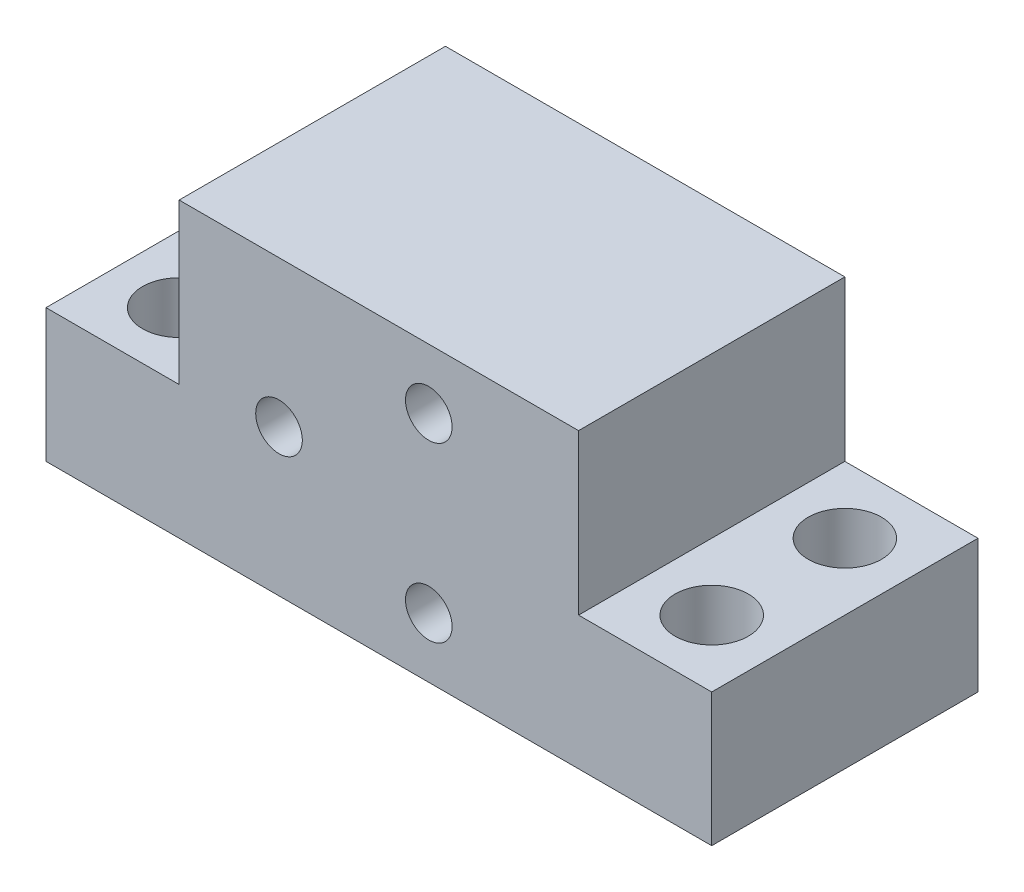
ISO-10303-21;
HEADER;
FILE_DESCRIPTION(('STEP AP214'),'2;1');
FILE_NAME('part.step','',(''),(''),'','','');
FILE_SCHEMA(('AUTOMOTIVE_DESIGN { 1 0 10303 214 1 1 1 1 }'));
ENDSEC;
DATA;
#1=APPLICATION_CONTEXT('core data for automotive mechanical design processes');
#2=APPLICATION_PROTOCOL_DEFINITION('international standard','automotive_design',2000,#1);
#3=PRODUCT_CONTEXT('',#1,'mechanical');
#4=PRODUCT('Part','Part','',(#3));
#5=PRODUCT_RELATED_PRODUCT_CATEGORY('part','',(#4));
#6=PRODUCT_DEFINITION_FORMATION('','',#4);
#7=PRODUCT_DEFINITION_CONTEXT('part definition',#1,'design');
#8=PRODUCT_DEFINITION('design','',#6,#7);
#9=PRODUCT_DEFINITION_SHAPE('','',#8);
#10=(LENGTH_UNIT() NAMED_UNIT(*) SI_UNIT(.MILLI.,.METRE.));
#11=(NAMED_UNIT(*) PLANE_ANGLE_UNIT() SI_UNIT($,.RADIAN.));
#12=(NAMED_UNIT(*) SI_UNIT($,.STERADIAN.) SOLID_ANGLE_UNIT());
#13=UNCERTAINTY_MEASURE_WITH_UNIT(LENGTH_MEASURE(1.E-05),#10,'distance_accuracy_value','');
#14=(GEOMETRIC_REPRESENTATION_CONTEXT(3) GLOBAL_UNCERTAINTY_ASSIGNED_CONTEXT((#13)) GLOBAL_UNIT_ASSIGNED_CONTEXT((#10,
#11,#12)) REPRESENTATION_CONTEXT('',''));
#15=CARTESIAN_POINT('',(0.,0.,0.));
#16=DIRECTION('',(0.,0.,1.));
#17=DIRECTION('',(1.,0.,0.));
#18=AXIS2_PLACEMENT_3D('',#15,#16,#17);
#19=CARTESIAN_POINT('',(15.,22.,-20.));
#20=DIRECTION('',(-1.,0.,0.));
#21=DIRECTION('',(0.,-1.,0.));
#22=AXIS2_PLACEMENT_3D('',#19,#20,#21);
#23=PLANE('',#22);
#24=DIRECTION('',(0.,1.,0.));
#25=VECTOR('',#24,1.);
#26=CARTESIAN_POINT('',(15.,22.,0.));
#27=LINE('',#26,#25);
#28=CARTESIAN_POINT('',(15.,10.,0.));
#29=VERTEX_POINT('',#28);
#30=CARTESIAN_POINT('',(15.,22.,0.));
#31=VERTEX_POINT('',#30);
#32=EDGE_CURVE('E113',#29,#31,#27,.T.);
#33=ORIENTED_EDGE('',*,*,#32,.F.);
#34=DIRECTION('',(0.,0.,1.));
#35=VECTOR('',#34,1.);
#36=CARTESIAN_POINT('',(15.,10.,-20.));
#37=LINE('',#36,#35);
#38=CARTESIAN_POINT('',(15.,10.,-20.));
#39=VERTEX_POINT('',#38);
#40=EDGE_CURVE('E112',#39,#29,#37,.T.);
#41=ORIENTED_EDGE('',*,*,#40,.F.);
#42=DIRECTION('',(0.,1.,0.));
#43=VECTOR('',#42,1.);
#44=CARTESIAN_POINT('',(15.,22.,-20.));
#45=LINE('',#44,#43);
#46=CARTESIAN_POINT('',(15.,22.,-20.));
#47=VERTEX_POINT('',#46);
#48=EDGE_CURVE('E132',#39,#47,#45,.T.);
#49=ORIENTED_EDGE('',*,*,#48,.T.);
#50=DIRECTION('',(0.,0.,1.));
#51=VECTOR('',#50,1.);
#52=CARTESIAN_POINT('',(15.,22.,-20.));
#53=LINE('',#52,#51);
#54=EDGE_CURVE('E11',#47,#31,#53,.T.);
#55=ORIENTED_EDGE('',*,*,#54,.T.);
#56=EDGE_LOOP('',(#33,#41,#49,#55));
#57=FACE_BOUND('',#56,.T.);
#58=ADVANCED_FACE('F17',(#57),#23,.F.);
#59=CARTESIAN_POINT('',(-15.,22.,-20.));
#60=DIRECTION('',(0.,-1.,0.));
#61=DIRECTION('',(0.,0.,1.));
#62=AXIS2_PLACEMENT_3D('',#59,#60,#61);
#63=PLANE('',#62);
#64=DIRECTION('',(-1.,0.,0.));
#65=VECTOR('',#64,1.);
#66=CARTESIAN_POINT('',(-15.,22.,0.));
#67=LINE('',#66,#65);
#68=CARTESIAN_POINT('',(-15.,22.,0.));
#69=VERTEX_POINT('',#68);
#70=EDGE_CURVE('E115',#31,#69,#67,.T.);
#71=ORIENTED_EDGE('',*,*,#70,.F.);
#72=ORIENTED_EDGE('',*,*,#54,.F.);
#73=DIRECTION('',(-1.,0.,0.));
#74=VECTOR('',#73,1.);
#75=CARTESIAN_POINT('',(-15.,22.,-20.));
#76=LINE('',#75,#74);
#77=CARTESIAN_POINT('',(-15.,22.,-20.));
#78=VERTEX_POINT('',#77);
#79=EDGE_CURVE('E71',#47,#78,#76,.T.);
#80=ORIENTED_EDGE('',*,*,#79,.T.);
#81=DIRECTION('',(0.,0.,1.));
#82=VECTOR('',#81,1.);
#83=CARTESIAN_POINT('',(-15.,22.,-20.));
#84=LINE('',#83,#82);
#85=EDGE_CURVE('E25',#78,#69,#84,.T.);
#86=ORIENTED_EDGE('',*,*,#85,.T.);
#87=EDGE_LOOP('',(#71,#72,#80,#86));
#88=FACE_BOUND('',#87,.T.);
#89=ADVANCED_FACE('F144',(#88),#63,.F.);
#90=CARTESIAN_POINT('',(-15.,22.,-20.));
#91=DIRECTION('',(1.,0.,0.));
#92=DIRECTION('',(0.,1.,0.));
#93=AXIS2_PLACEMENT_3D('',#90,#91,#92);
#94=PLANE('',#93);
#95=DIRECTION('',(0.,-1.,0.));
#96=VECTOR('',#95,1.);
#97=CARTESIAN_POINT('',(-15.,22.,0.));
#98=LINE('',#97,#96);
#99=CARTESIAN_POINT('',(-15.,10.,0.));
#100=VERTEX_POINT('',#99);
#101=EDGE_CURVE('E119',#69,#100,#98,.T.);
#102=ORIENTED_EDGE('',*,*,#101,.F.);
#103=ORIENTED_EDGE('',*,*,#85,.F.);
#104=DIRECTION('',(0.,-1.,0.));
#105=VECTOR('',#104,1.);
#106=CARTESIAN_POINT('',(-15.,22.,-20.));
#107=LINE('',#106,#105);
#108=CARTESIAN_POINT('',(-15.,10.,-20.));
#109=VERTEX_POINT('',#108);
#110=EDGE_CURVE('E153',#78,#109,#107,.T.);
#111=ORIENTED_EDGE('',*,*,#110,.T.);
#112=DIRECTION('',(0.,0.,1.));
#113=VECTOR('',#112,1.);
#114=CARTESIAN_POINT('',(-15.,10.,-20.));
#115=LINE('',#114,#113);
#116=EDGE_CURVE('E139',#109,#100,#115,.T.);
#117=ORIENTED_EDGE('',*,*,#116,.T.);
#118=EDGE_LOOP('',(#102,#103,#111,#117));
#119=FACE_BOUND('',#118,.T.);
#120=ADVANCED_FACE('F166',(#119),#94,.F.);
#121=CARTESIAN_POINT('',(-15.,10.,-20.));
#122=DIRECTION('',(0.,-1.,0.));
#123=DIRECTION('',(0.,0.,1.));
#124=AXIS2_PLACEMENT_3D('',#121,#122,#123);
#125=PLANE('',#124);
#126=CARTESIAN_POINT('',(-20.,10.,-15.));
#127=DIRECTION('',(0.,-1.,0.));
#128=DIRECTION('',(0.,0.,-1.));
#129=AXIS2_PLACEMENT_3D('',#126,#127,#128);
#130=CIRCLE('',#129,2.75);
#131=CARTESIAN_POINT('',(-20.,10.,-17.75));
#132=VERTEX_POINT('',#131);
#133=EDGE_CURVE('E370',#132,#132,#130,.T.);
#134=ORIENTED_EDGE('',*,*,#133,.T.);
#135=EDGE_LOOP('',(#134));
#136=FACE_BOUND('',#135,.T.);
#137=CARTESIAN_POINT('',(-20.,10.,-5.));
#138=DIRECTION('',(0.,-1.,0.));
#139=DIRECTION('',(0.,0.,-1.));
#140=AXIS2_PLACEMENT_3D('',#137,#138,#139);
#141=CIRCLE('',#140,2.75);
#142=CARTESIAN_POINT('',(-20.,10.,-7.75));
#143=VERTEX_POINT('',#142);
#144=EDGE_CURVE('E376',#143,#143,#141,.T.);
#145=ORIENTED_EDGE('',*,*,#144,.T.);
#146=EDGE_LOOP('',(#145));
#147=FACE_BOUND('',#146,.T.);
#148=DIRECTION('',(-1.,0.,0.));
#149=VECTOR('',#148,1.);
#150=CARTESIAN_POINT('',(-15.,10.,0.));
#151=LINE('',#150,#149);
#152=CARTESIAN_POINT('',(-25.,10.,0.));
#153=VERTEX_POINT('',#152);
#154=EDGE_CURVE('E122',#100,#153,#151,.T.);
#155=ORIENTED_EDGE('',*,*,#154,.F.);
#156=ORIENTED_EDGE('',*,*,#116,.F.);
#157=DIRECTION('',(-1.,0.,0.));
#158=VECTOR('',#157,1.);
#159=CARTESIAN_POINT('',(-15.,10.,-20.));
#160=LINE('',#159,#158);
#161=CARTESIAN_POINT('',(-25.,10.,-20.));
#162=VERTEX_POINT('',#161);
#163=EDGE_CURVE('E107',#109,#162,#160,.T.);
#164=ORIENTED_EDGE('',*,*,#163,.T.);
#165=DIRECTION('',(0.,0.,1.));
#166=VECTOR('',#165,1.);
#167=CARTESIAN_POINT('',(-25.,10.,-20.));
#168=LINE('',#167,#166);
#169=EDGE_CURVE('E136',#162,#153,#168,.T.);
#170=ORIENTED_EDGE('',*,*,#169,.T.);
#171=EDGE_LOOP('',(#155,#156,#164,#170));
#172=FACE_BOUND('',#171,.T.);
#173=ADVANCED_FACE('F162',(#136,#147,#172),#125,.F.);
#174=CARTESIAN_POINT('',(-25.,10.,-20.));
#175=DIRECTION('',(1.,0.,0.));
#176=DIRECTION('',(0.,0.,1.));
#177=AXIS2_PLACEMENT_3D('',#174,#175,#176);
#178=PLANE('',#177);
#179=DIRECTION('',(0.,-1.,0.));
#180=VECTOR('',#179,1.);
#181=CARTESIAN_POINT('',(-25.,10.,0.));
#182=LINE('',#181,#180);
#183=CARTESIAN_POINT('',(-25.,0.,0.));
#184=VERTEX_POINT('',#183);
#185=EDGE_CURVE('E125',#153,#184,#182,.T.);
#186=ORIENTED_EDGE('',*,*,#185,.F.);
#187=ORIENTED_EDGE('',*,*,#169,.F.);
#188=DIRECTION('',(0.,-1.,0.));
#189=VECTOR('',#188,1.);
#190=CARTESIAN_POINT('',(-25.,10.,-20.));
#191=LINE('',#190,#189);
#192=CARTESIAN_POINT('',(-25.,0.,-20.));
#193=VERTEX_POINT('',#192);
#194=EDGE_CURVE('E105',#162,#193,#191,.T.);
#195=ORIENTED_EDGE('',*,*,#194,.T.);
#196=DIRECTION('',(0.,0.,1.));
#197=VECTOR('',#196,1.);
#198=CARTESIAN_POINT('',(-25.,0.,-20.));
#199=LINE('',#198,#197);
#200=EDGE_CURVE('E99',#193,#184,#199,.T.);
#201=ORIENTED_EDGE('',*,*,#200,.T.);
#202=EDGE_LOOP('',(#186,#187,#195,#201));
#203=FACE_BOUND('',#202,.T.);
#204=ADVANCED_FACE('F165',(#203),#178,.F.);
#205=CARTESIAN_POINT('',(25.,0.,-20.));
#206=DIRECTION('',(0.,1.,0.));
#207=DIRECTION('',(0.,0.,-1.));
#208=AXIS2_PLACEMENT_3D('',#205,#206,#207);
#209=PLANE('',#208);
#210=CARTESIAN_POINT('',(-20.,0.,-15.));
#211=DIRECTION('',(0.,-1.,0.));
#212=DIRECTION('',(0.,0.,-1.));
#213=AXIS2_PLACEMENT_3D('',#210,#211,#212);
#214=CIRCLE('',#213,2.75);
#215=CARTESIAN_POINT('',(-20.,0.,-17.75));
#216=VERTEX_POINT('',#215);
#217=EDGE_CURVE('E373',#216,#216,#214,.T.);
#218=ORIENTED_EDGE('',*,*,#217,.F.);
#219=EDGE_LOOP('',(#218));
#220=FACE_BOUND('',#219,.T.);
#221=CARTESIAN_POINT('',(-20.,0.,-5.));
#222=DIRECTION('',(0.,-1.,0.));
#223=DIRECTION('',(0.,0.,-1.));
#224=AXIS2_PLACEMENT_3D('',#221,#222,#223);
#225=CIRCLE('',#224,2.75);
#226=CARTESIAN_POINT('',(-20.,0.,-7.75));
#227=VERTEX_POINT('',#226);
#228=EDGE_CURVE('E379',#227,#227,#225,.T.);
#229=ORIENTED_EDGE('',*,*,#228,.F.);
#230=EDGE_LOOP('',(#229));
#231=FACE_BOUND('',#230,.T.);
#232=CARTESIAN_POINT('',(20.,0.,-15.));
#233=DIRECTION('',(0.,-1.,0.));
#234=DIRECTION('',(0.,0.,-1.));
#235=AXIS2_PLACEMENT_3D('',#232,#233,#234);
#236=CIRCLE('',#235,2.75);
#237=CARTESIAN_POINT('',(20.,0.,-17.75));
#238=VERTEX_POINT('',#237);
#239=EDGE_CURVE('E385',#238,#238,#236,.T.);
#240=ORIENTED_EDGE('',*,*,#239,.F.);
#241=EDGE_LOOP('',(#240));
#242=FACE_BOUND('',#241,.T.);
#243=CARTESIAN_POINT('',(20.,0.,-5.));
#244=DIRECTION('',(0.,-1.,0.));
#245=DIRECTION('',(0.,0.,-1.));
#246=AXIS2_PLACEMENT_3D('',#243,#244,#245);
#247=CIRCLE('',#246,2.75);
#248=CARTESIAN_POINT('',(20.,0.,-7.75));
#249=VERTEX_POINT('',#248);
#250=EDGE_CURVE('E391',#249,#249,#247,.T.);
#251=ORIENTED_EDGE('',*,*,#250,.F.);
#252=EDGE_LOOP('',(#251));
#253=FACE_BOUND('',#252,.T.);
#254=DIRECTION('',(1.,0.,0.));
#255=VECTOR('',#254,1.);
#256=CARTESIAN_POINT('',(25.,0.,0.));
#257=LINE('',#256,#255);
#258=CARTESIAN_POINT('',(25.,0.,0.));
#259=VERTEX_POINT('',#258);
#260=EDGE_CURVE('E128',#184,#259,#257,.T.);
#261=ORIENTED_EDGE('',*,*,#260,.F.);
#262=ORIENTED_EDGE('',*,*,#200,.F.);
#263=DIRECTION('',(1.,0.,0.));
#264=VECTOR('',#263,1.);
#265=CARTESIAN_POINT('',(25.,0.,-20.));
#266=LINE('',#265,#264);
#267=CARTESIAN_POINT('',(25.,0.,-20.));
#268=VERTEX_POINT('',#267);
#269=EDGE_CURVE('E89',#193,#268,#266,.T.);
#270=ORIENTED_EDGE('',*,*,#269,.T.);
#271=DIRECTION('',(0.,0.,1.));
#272=VECTOR('',#271,1.);
#273=CARTESIAN_POINT('',(25.,0.,-20.));
#274=LINE('',#273,#272);
#275=EDGE_CURVE('E94',#268,#259,#274,.T.);
#276=ORIENTED_EDGE('',*,*,#275,.T.);
#277=EDGE_LOOP('',(#261,#262,#270,#276));
#278=FACE_BOUND('',#277,.T.);
#279=ADVANCED_FACE('F102',(#220,#231,#242,#253,#278),#209,.F.);
#280=CARTESIAN_POINT('',(25.,10.,-20.));
#281=DIRECTION('',(-1.,0.,0.));
#282=DIRECTION('',(0.,0.,-1.));
#283=AXIS2_PLACEMENT_3D('',#280,#281,#282);
#284=PLANE('',#283);
#285=DIRECTION('',(0.,1.,0.));
#286=VECTOR('',#285,1.);
#287=CARTESIAN_POINT('',(25.,10.,0.));
#288=LINE('',#287,#286);
#289=CARTESIAN_POINT('',(25.,10.,0.));
#290=VERTEX_POINT('',#289);
#291=EDGE_CURVE('E96',#259,#290,#288,.T.);
#292=ORIENTED_EDGE('',*,*,#291,.F.);
#293=ORIENTED_EDGE('',*,*,#275,.F.);
#294=DIRECTION('',(0.,1.,0.));
#295=VECTOR('',#294,1.);
#296=CARTESIAN_POINT('',(25.,10.,-20.));
#297=LINE('',#296,#295);
#298=CARTESIAN_POINT('',(25.,10.,-20.));
#299=VERTEX_POINT('',#298);
#300=EDGE_CURVE('E85',#268,#299,#297,.T.);
#301=ORIENTED_EDGE('',*,*,#300,.T.);
#302=DIRECTION('',(0.,0.,1.));
#303=VECTOR('',#302,1.);
#304=CARTESIAN_POINT('',(25.,10.,-20.));
#305=LINE('',#304,#303);
#306=EDGE_CURVE('E100',#299,#290,#305,.T.);
#307=ORIENTED_EDGE('',*,*,#306,.T.);
#308=EDGE_LOOP('',(#292,#293,#301,#307));
#309=FACE_BOUND('',#308,.T.);
#310=ADVANCED_FACE('F95',(#309),#284,.F.);
#311=CARTESIAN_POINT('',(15.,10.,-20.));
#312=DIRECTION('',(0.,-1.,0.));
#313=DIRECTION('',(0.,0.,1.));
#314=AXIS2_PLACEMENT_3D('',#311,#312,#313);
#315=PLANE('',#314);
#316=CARTESIAN_POINT('',(20.,10.,-15.));
#317=DIRECTION('',(0.,-1.,0.));
#318=DIRECTION('',(0.,0.,-1.));
#319=AXIS2_PLACEMENT_3D('',#316,#317,#318);
#320=CIRCLE('',#319,2.75);
#321=CARTESIAN_POINT('',(20.,10.,-17.75));
#322=VERTEX_POINT('',#321);
#323=EDGE_CURVE('E382',#322,#322,#320,.T.);
#324=ORIENTED_EDGE('',*,*,#323,.T.);
#325=EDGE_LOOP('',(#324));
#326=FACE_BOUND('',#325,.T.);
#327=CARTESIAN_POINT('',(20.,10.,-5.));
#328=DIRECTION('',(0.,-1.,0.));
#329=DIRECTION('',(0.,0.,-1.));
#330=AXIS2_PLACEMENT_3D('',#327,#328,#329);
#331=CIRCLE('',#330,2.75);
#332=CARTESIAN_POINT('',(20.,10.,-7.75));
#333=VERTEX_POINT('',#332);
#334=EDGE_CURVE('E388',#333,#333,#331,.T.);
#335=ORIENTED_EDGE('',*,*,#334,.T.);
#336=EDGE_LOOP('',(#335));
#337=FACE_BOUND('',#336,.T.);
#338=DIRECTION('',(-1.,0.,0.));
#339=VECTOR('',#338,1.);
#340=CARTESIAN_POINT('',(15.,10.,0.));
#341=LINE('',#340,#339);
#342=EDGE_CURVE('E59',#290,#29,#341,.T.);
#343=ORIENTED_EDGE('',*,*,#342,.F.);
#344=ORIENTED_EDGE('',*,*,#306,.F.);
#345=DIRECTION('',(-1.,0.,0.));
#346=VECTOR('',#345,1.);
#347=CARTESIAN_POINT('',(15.,10.,-20.));
#348=LINE('',#347,#346);
#349=EDGE_CURVE('E33',#299,#39,#348,.T.);
#350=ORIENTED_EDGE('',*,*,#349,.T.);
#351=ORIENTED_EDGE('',*,*,#40,.T.);
#352=EDGE_LOOP('',(#343,#344,#350,#351));
#353=FACE_BOUND('',#352,.T.);
#354=ADVANCED_FACE('F225',(#326,#337,#353),#315,.F.);
#355=CARTESIAN_POINT('',(0.,0.,-20.));
#356=DIRECTION('',(0.,0.,-1.));
#357=DIRECTION('',(1.,0.,0.));
#358=AXIS2_PLACEMENT_3D('',#355,#356,#357);
#359=PLANE('',#358);
#360=CARTESIAN_POINT('',(0.,11.,-20.));
#361=DIRECTION('',(0.,0.,1.));
#362=DIRECTION('',(1.,0.,0.));
#363=AXIS2_PLACEMENT_3D('',#360,#361,#362);
#364=CIRCLE('',#363,10.);
#365=CARTESIAN_POINT('',(10.,11.,-20.));
#366=VERTEX_POINT('',#365);
#367=EDGE_CURVE('E156',#366,#366,#364,.T.);
#368=ORIENTED_EDGE('',*,*,#367,.T.);
#369=EDGE_LOOP('',(#368));
#370=FACE_BOUND('',#369,.T.);
#371=ORIENTED_EDGE('',*,*,#48,.F.);
#372=ORIENTED_EDGE('',*,*,#349,.F.);
#373=ORIENTED_EDGE('',*,*,#300,.F.);
#374=ORIENTED_EDGE('',*,*,#269,.F.);
#375=ORIENTED_EDGE('',*,*,#194,.F.);
#376=ORIENTED_EDGE('',*,*,#163,.F.);
#377=ORIENTED_EDGE('',*,*,#110,.F.);
#378=ORIENTED_EDGE('',*,*,#79,.F.);
#379=EDGE_LOOP('',(#371,#372,#373,#374,#375,#376,#377,#378));
#380=FACE_BOUND('',#379,.T.);
#381=ADVANCED_FACE('F87',(#370,#380),#359,.T.);
#382=CARTESIAN_POINT('',(0.,0.,0.));
#383=DIRECTION('',(0.,0.,-1.));
#384=DIRECTION('',(1.,0.,0.));
#385=AXIS2_PLACEMENT_3D('',#382,#383,#384);
#386=PLANE('',#385);
#387=CARTESIAN_POINT('',(3.74999999999994,17.4951905283833,0.));
#388=DIRECTION('',(0.,0.,-1.));
#389=DIRECTION('',(-1.,0.,0.));
#390=AXIS2_PLACEMENT_3D('',#387,#388,#389);
#391=CIRCLE('',#390,1.75);
#392=CARTESIAN_POINT('',(1.99999999999994,17.4951905283833,0.));
#393=VERTEX_POINT('',#392);
#394=EDGE_CURVE('E354',#393,#393,#391,.T.);
#395=ORIENTED_EDGE('',*,*,#394,.T.);
#396=EDGE_LOOP('',(#395));
#397=FACE_BOUND('',#396,.T.);
#398=CARTESIAN_POINT('',(3.75,4.50480947161673,0.));
#399=DIRECTION('',(0.,0.,-1.));
#400=DIRECTION('',(-1.,0.,0.));
#401=AXIS2_PLACEMENT_3D('',#398,#399,#400);
#402=CIRCLE('',#401,1.75);
#403=CARTESIAN_POINT('',(2.,4.50480947161673,0.));
#404=VERTEX_POINT('',#403);
#405=EDGE_CURVE('E356',#404,#404,#402,.T.);
#406=ORIENTED_EDGE('',*,*,#405,.T.);
#407=EDGE_LOOP('',(#406));
#408=FACE_BOUND('',#407,.T.);
#409=CARTESIAN_POINT('',(-7.5,11.,0.));
#410=DIRECTION('',(0.,0.,-1.));
#411=DIRECTION('',(-1.,0.,0.));
#412=AXIS2_PLACEMENT_3D('',#409,#410,#411);
#413=CIRCLE('',#412,1.75);
#414=CARTESIAN_POINT('',(-9.25,11.,0.));
#415=VERTEX_POINT('',#414);
#416=EDGE_CURVE('E364',#415,#415,#413,.T.);
#417=ORIENTED_EDGE('',*,*,#416,.T.);
#418=EDGE_LOOP('',(#417));
#419=FACE_BOUND('',#418,.T.);
#420=ORIENTED_EDGE('',*,*,#32,.T.);
#421=ORIENTED_EDGE('',*,*,#70,.T.);
#422=ORIENTED_EDGE('',*,*,#101,.T.);
#423=ORIENTED_EDGE('',*,*,#154,.T.);
#424=ORIENTED_EDGE('',*,*,#185,.T.);
#425=ORIENTED_EDGE('',*,*,#260,.T.);
#426=ORIENTED_EDGE('',*,*,#291,.T.);
#427=ORIENTED_EDGE('',*,*,#342,.T.);
#428=EDGE_LOOP('',(#420,#421,#422,#423,#424,#425,#426,#427));
#429=FACE_BOUND('',#428,.T.);
#430=ADVANCED_FACE('F147',(#397,#408,#419,#429),#386,.F.);
#431=CARTESIAN_POINT('',(0.,11.,-19.));
#432=DIRECTION('',(0.,0.,-1.));
#433=DIRECTION('',(1.,0.,0.));
#434=AXIS2_PLACEMENT_3D('',#431,#432,#433);
#435=CYLINDRICAL_SURFACE('',#434,10.);
#436=CARTESIAN_POINT('',(0.,11.,-19.));
#437=DIRECTION('',(0.,0.,1.));
#438=DIRECTION('',(1.,0.,0.));
#439=AXIS2_PLACEMENT_3D('',#436,#437,#438);
#440=CIRCLE('',#439,10.);
#441=CARTESIAN_POINT('',(10.,11.,-19.));
#442=VERTEX_POINT('',#441);
#443=EDGE_CURVE('E116',#442,#442,#440,.T.);
#444=ORIENTED_EDGE('',*,*,#443,.T.);
#445=EDGE_LOOP('',(#444));
#446=FACE_BOUND('',#445,.T.);
#447=ORIENTED_EDGE('',*,*,#367,.F.);
#448=EDGE_LOOP('',(#447));
#449=FACE_BOUND('',#448,.T.);
#450=ADVANCED_FACE('F252',(#446,#449),#435,.F.);
#451=CARTESIAN_POINT('',(0.,11.,-19.));
#452=DIRECTION('',(0.,0.,-1.));
#453=DIRECTION('',(1.,0.,0.));
#454=AXIS2_PLACEMENT_3D('',#451,#452,#453);
#455=PLANE('',#454);
#456=CARTESIAN_POINT('',(3.74999999999994,17.4951905283833,-19.));
#457=DIRECTION('',(0.,0.,1.));
#458=DIRECTION('',(1.,0.,0.));
#459=AXIS2_PLACEMENT_3D('',#456,#457,#458);
#460=CIRCLE('',#459,1.75);
#461=CARTESIAN_POINT('',(5.49999999999994,17.4951905283833,-19.));
#462=VERTEX_POINT('',#461);
#463=EDGE_CURVE('E351',#462,#462,#460,.T.);
#464=ORIENTED_EDGE('',*,*,#463,.T.);
#465=EDGE_LOOP('',(#464));
#466=FACE_BOUND('',#465,.T.);
#467=CARTESIAN_POINT('',(3.75,4.50480947161673,-19.));
#468=DIRECTION('',(0.,0.,1.));
#469=DIRECTION('',(1.,0.,0.));
#470=AXIS2_PLACEMENT_3D('',#467,#468,#469);
#471=CIRCLE('',#470,1.75);
#472=CARTESIAN_POINT('',(5.5,4.50480947161673,-19.));
#473=VERTEX_POINT('',#472);
#474=EDGE_CURVE('E361',#473,#473,#471,.T.);
#475=ORIENTED_EDGE('',*,*,#474,.T.);
#476=EDGE_LOOP('',(#475));
#477=FACE_BOUND('',#476,.T.);
#478=CARTESIAN_POINT('',(-7.5,11.,-19.));
#479=DIRECTION('',(0.,0.,1.));
#480=DIRECTION('',(1.,0.,0.));
#481=AXIS2_PLACEMENT_3D('',#478,#479,#480);
#482=CIRCLE('',#481,1.75);
#483=CARTESIAN_POINT('',(-5.75,11.,-19.));
#484=VERTEX_POINT('',#483);
#485=EDGE_CURVE('E367',#484,#484,#482,.T.);
#486=ORIENTED_EDGE('',*,*,#485,.T.);
#487=EDGE_LOOP('',(#486));
#488=FACE_BOUND('',#487,.T.);
#489=ORIENTED_EDGE('',*,*,#443,.F.);
#490=EDGE_LOOP('',(#489));
#491=FACE_BOUND('',#490,.T.);
#492=ADVANCED_FACE('F262',(#466,#477,#488,#491),#455,.T.);
#493=CARTESIAN_POINT('',(20.,10.,-5.));
#494=DIRECTION('',(0.,1.,0.));
#495=DIRECTION('',(0.,0.,-1.));
#496=AXIS2_PLACEMENT_3D('',#493,#494,#495);
#497=CYLINDRICAL_SURFACE('',#496,2.75);
#498=ORIENTED_EDGE('',*,*,#250,.T.);
#499=EDGE_LOOP('',(#498));
#500=FACE_BOUND('',#499,.T.);
#501=ORIENTED_EDGE('',*,*,#334,.F.);
#502=EDGE_LOOP('',(#501));
#503=FACE_BOUND('',#502,.T.);
#504=ADVANCED_FACE('F272',(#500,#503),#497,.F.);
#505=CARTESIAN_POINT('',(20.,10.,-15.));
#506=DIRECTION('',(0.,1.,0.));
#507=DIRECTION('',(0.,0.,-1.));
#508=AXIS2_PLACEMENT_3D('',#505,#506,#507);
#509=CYLINDRICAL_SURFACE('',#508,2.75);
#510=ORIENTED_EDGE('',*,*,#239,.T.);
#511=EDGE_LOOP('',(#510));
#512=FACE_BOUND('',#511,.T.);
#513=ORIENTED_EDGE('',*,*,#323,.F.);
#514=EDGE_LOOP('',(#513));
#515=FACE_BOUND('',#514,.T.);
#516=ADVANCED_FACE('F282',(#512,#515),#509,.F.);
#517=CARTESIAN_POINT('',(-20.,10.,-5.));
#518=DIRECTION('',(0.,1.,0.));
#519=DIRECTION('',(0.,0.,-1.));
#520=AXIS2_PLACEMENT_3D('',#517,#518,#519);
#521=CYLINDRICAL_SURFACE('',#520,2.75);
#522=ORIENTED_EDGE('',*,*,#228,.T.);
#523=EDGE_LOOP('',(#522));
#524=FACE_BOUND('',#523,.T.);
#525=ORIENTED_EDGE('',*,*,#144,.F.);
#526=EDGE_LOOP('',(#525));
#527=FACE_BOUND('',#526,.T.);
#528=ADVANCED_FACE('F292',(#524,#527),#521,.F.);
#529=CARTESIAN_POINT('',(-20.,10.,-15.));
#530=DIRECTION('',(0.,1.,0.));
#531=DIRECTION('',(0.,0.,-1.));
#532=AXIS2_PLACEMENT_3D('',#529,#530,#531);
#533=CYLINDRICAL_SURFACE('',#532,2.75);
#534=ORIENTED_EDGE('',*,*,#217,.T.);
#535=EDGE_LOOP('',(#534));
#536=FACE_BOUND('',#535,.T.);
#537=ORIENTED_EDGE('',*,*,#133,.F.);
#538=EDGE_LOOP('',(#537));
#539=FACE_BOUND('',#538,.T.);
#540=ADVANCED_FACE('F302',(#536,#539),#533,.F.);
#541=CARTESIAN_POINT('',(-7.5,11.,0.));
#542=DIRECTION('',(0.,0.,1.));
#543=DIRECTION('',(-1.,0.,0.));
#544=AXIS2_PLACEMENT_3D('',#541,#542,#543);
#545=CYLINDRICAL_SURFACE('',#544,1.75);
#546=ORIENTED_EDGE('',*,*,#485,.F.);
#547=EDGE_LOOP('',(#546));
#548=FACE_BOUND('',#547,.T.);
#549=ORIENTED_EDGE('',*,*,#416,.F.);
#550=EDGE_LOOP('',(#549));
#551=FACE_BOUND('',#550,.T.);
#552=ADVANCED_FACE('F312',(#548,#551),#545,.F.);
#553=CARTESIAN_POINT('',(3.75,4.50480947161673,0.));
#554=DIRECTION('',(0.,0.,1.));
#555=DIRECTION('',(-1.,0.,0.));
#556=AXIS2_PLACEMENT_3D('',#553,#554,#555);
#557=CYLINDRICAL_SURFACE('',#556,1.75);
#558=ORIENTED_EDGE('',*,*,#474,.F.);
#559=EDGE_LOOP('',(#558));
#560=FACE_BOUND('',#559,.T.);
#561=ORIENTED_EDGE('',*,*,#405,.F.);
#562=EDGE_LOOP('',(#561));
#563=FACE_BOUND('',#562,.T.);
#564=ADVANCED_FACE('F322',(#560,#563),#557,.F.);
#565=CARTESIAN_POINT('',(3.74999999999994,17.4951905283833,0.));
#566=DIRECTION('',(0.,0.,1.));
#567=DIRECTION('',(-1.,0.,0.));
#568=AXIS2_PLACEMENT_3D('',#565,#566,#567);
#569=CYLINDRICAL_SURFACE('',#568,1.75);
#570=ORIENTED_EDGE('',*,*,#463,.F.);
#571=EDGE_LOOP('',(#570));
#572=FACE_BOUND('',#571,.T.);
#573=ORIENTED_EDGE('',*,*,#394,.F.);
#574=EDGE_LOOP('',(#573));
#575=FACE_BOUND('',#574,.T.);
#576=ADVANCED_FACE('F332',(#572,#575),#569,.F.);
#577=CLOSED_SHELL('',(#58,#89,#120,#173,#204,#279,#310,#354,#381,#430,#450,#492,#504,#516,#528,
#540,#552,#564,#576));
#578=MANIFOLD_SOLID_BREP('B1',#577);
#579=ADVANCED_BREP_SHAPE_REPRESENTATION('',(#18,#578),#14);
#580=SHAPE_DEFINITION_REPRESENTATION(#9,#579);
ENDSEC;
END-ISO-10303-21;
